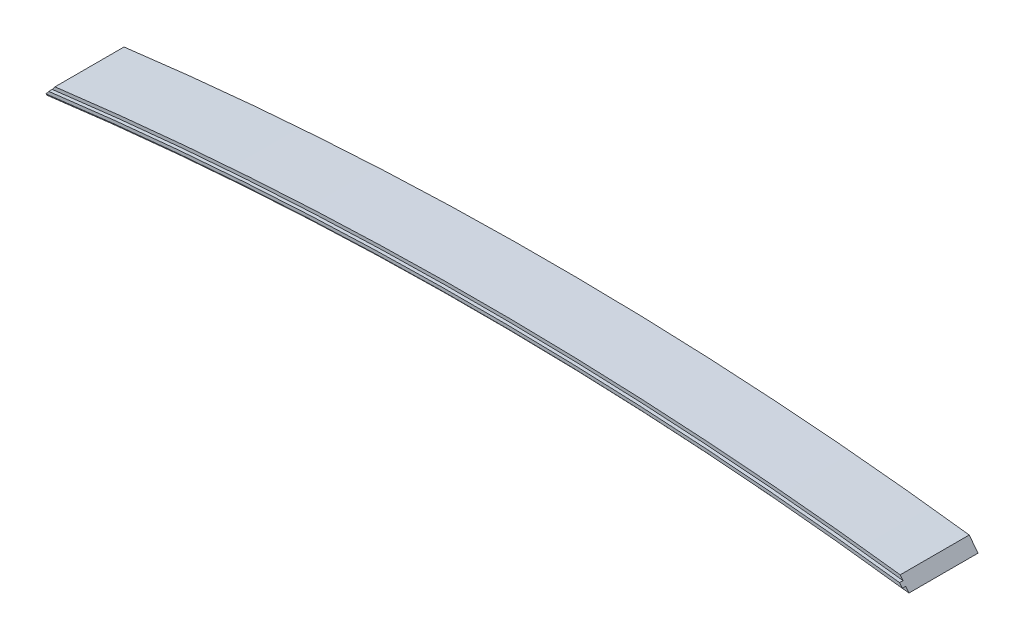
ISO-10303-21;
HEADER;
FILE_DESCRIPTION(('STEP AP214'),'2;1');
FILE_NAME('part.step','',(''),(''),'','','');
FILE_SCHEMA(('AUTOMOTIVE_DESIGN { 1 0 10303 214 1 1 1 1 }'));
ENDSEC;
DATA;
#1=APPLICATION_CONTEXT('core data for automotive mechanical design processes');
#2=APPLICATION_PROTOCOL_DEFINITION('international standard','automotive_design',2000,#1);
#3=PRODUCT_CONTEXT('',#1,'mechanical');
#4=PRODUCT('Part','Part','',(#3));
#5=PRODUCT_RELATED_PRODUCT_CATEGORY('part','',(#4));
#6=PRODUCT_DEFINITION_FORMATION('','',#4);
#7=PRODUCT_DEFINITION_CONTEXT('part definition',#1,'design');
#8=PRODUCT_DEFINITION('design','',#6,#7);
#9=PRODUCT_DEFINITION_SHAPE('','',#8);
#10=(LENGTH_UNIT() NAMED_UNIT(*) SI_UNIT(.MILLI.,.METRE.));
#11=(NAMED_UNIT(*) PLANE_ANGLE_UNIT() SI_UNIT($,.RADIAN.));
#12=(NAMED_UNIT(*) SI_UNIT($,.STERADIAN.) SOLID_ANGLE_UNIT());
#13=UNCERTAINTY_MEASURE_WITH_UNIT(LENGTH_MEASURE(1.E-05),#10,'distance_accuracy_value','');
#14=(GEOMETRIC_REPRESENTATION_CONTEXT(3) GLOBAL_UNCERTAINTY_ASSIGNED_CONTEXT((#13)) GLOBAL_UNIT_ASSIGNED_CONTEXT((#10,
#11,#12)) REPRESENTATION_CONTEXT('',''));
#15=CARTESIAN_POINT('',(0.,0.,0.));
#16=DIRECTION('',(0.,0.,1.));
#17=DIRECTION('',(1.,0.,0.));
#18=AXIS2_PLACEMENT_3D('',#15,#16,#17);
#19=CARTESIAN_POINT('',(0.,-4954.48624508701,101.6));
#20=DIRECTION('',(0.,0.,1.));
#21=DIRECTION('',(1.,0.,0.));
#22=AXIS2_PLACEMENT_3D('',#19,#20,#21);
#23=PLANE('',#22);
#24=CARTESIAN_POINT('',(0.,-4954.48624508701,101.6));
#25=DIRECTION('',(0.,0.,-1.));
#26=DIRECTION('',(1.,0.,0.));
#27=AXIS2_PLACEMENT_3D('',#24,#25,#26);
#28=CIRCLE('',#27,4901.37548046057);
#29=CARTESIAN_POINT('',(-630.252313320326,-93.8007356126036,101.6));
#30=VERTEX_POINT('',#29);
#31=CARTESIAN_POINT('',(630.252313320327,-93.800735612604,101.6));
#32=VERTEX_POINT('',#31);
#33=EDGE_CURVE('E118',#30,#32,#28,.T.);
#34=ORIENTED_EDGE('',*,*,#33,.F.);
#35=DIRECTION('',(-0.609421241288323,-0.792846612319558,0.));
#36=VECTOR('',#35,1.);
#37=CARTESIAN_POINT('',(-635.,-99.9773947857841,101.6));
#38=LINE('',#37,#36);
#39=CARTESIAN_POINT('',(-635.,-99.9773947857854,101.6));
#40=VERTEX_POINT('',#39);
#41=EDGE_CURVE('E131',#30,#40,#38,.T.);
#42=ORIENTED_EDGE('',*,*,#41,.T.);
#43=CARTESIAN_POINT('',(0.,-4954.48624508701,101.6));
#44=DIRECTION('',(0.,0.,-1.));
#45=DIRECTION('',(1.,0.,0.));
#46=AXIS2_PLACEMENT_3D('',#43,#44,#45);
#47=CIRCLE('',#46,4895.86368046057);
#48=CARTESIAN_POINT('',(635.,-99.9773947857841,101.6));
#49=VERTEX_POINT('',#48);
#50=EDGE_CURVE('E135',#40,#49,#47,.T.);
#51=ORIENTED_EDGE('',*,*,#50,.T.);
#52=DIRECTION('',(-0.609421241288271,0.792846612319598,0.));
#53=VECTOR('',#52,1.);
#54=CARTESIAN_POINT('',(635.,-99.9773947857841,101.6));
#55=LINE('',#54,#53);
#56=EDGE_CURVE('E55',#49,#32,#55,.T.);
#57=ORIENTED_EDGE('',*,*,#56,.T.);
#58=EDGE_LOOP('',(#34,#42,#51,#57));
#59=FACE_BOUND('',#58,.T.);
#60=ADVANCED_FACE('F32',(#59),#23,.T.);
#61=CARTESIAN_POINT('',(0.,-4954.48624508701,101.6));
#62=DIRECTION('',(0.,0.,-1.));
#63=DIRECTION('',(-1.,0.,0.));
#64=AXIS2_PLACEMENT_3D('',#61,#62,#63);
#65=CYLINDRICAL_SURFACE('',#64,4910.84968046057);
#66=CARTESIAN_POINT('',(0.,-4954.48624508701,0.));
#67=DIRECTION('',(0.,0.,1.));
#68=DIRECTION('',(1.,0.,0.));
#69=AXIS2_PLACEMENT_3D('',#66,#67,#68);
#70=CIRCLE('',#69,4910.84968046057);
#71=CARTESIAN_POINT('',(622.103936150614,-83.1998362720223,0.));
#72=VERTEX_POINT('',#71);
#73=CARTESIAN_POINT('',(-622.103936150612,-83.1998362720223,0.));
#74=VERTEX_POINT('',#73);
#75=EDGE_CURVE('E119',#72,#74,#70,.T.);
#76=ORIENTED_EDGE('',*,*,#75,.T.);
#77=DIRECTION('',(0.,0.,-1.));
#78=VECTOR('',#77,1.);
#79=CARTESIAN_POINT('',(-622.103936150612,-83.1998362720223,101.6));
#80=LINE('',#79,#78);
#81=CARTESIAN_POINT('',(-622.103936150612,-83.1998362720223,101.6));
#82=VERTEX_POINT('',#81);
#83=EDGE_CURVE('E11',#82,#74,#80,.T.);
#84=ORIENTED_EDGE('',*,*,#83,.F.);
#85=CARTESIAN_POINT('',(0.,-4954.48624508701,101.6));
#86=DIRECTION('',(0.,0.,1.));
#87=DIRECTION('',(1.,0.,0.));
#88=AXIS2_PLACEMENT_3D('',#85,#86,#87);
#89=CIRCLE('',#88,4910.84968046057);
#90=CARTESIAN_POINT('',(622.103936150614,-83.1998362720223,101.6));
#91=VERTEX_POINT('',#90);
#92=EDGE_CURVE('E128',#91,#82,#89,.T.);
#93=ORIENTED_EDGE('',*,*,#92,.F.);
#94=DIRECTION('',(0.,0.,-1.));
#95=VECTOR('',#94,1.);
#96=CARTESIAN_POINT('',(622.103936150614,-83.1998362720223,101.6));
#97=LINE('',#96,#95);
#98=EDGE_CURVE('E138',#91,#72,#97,.T.);
#99=ORIENTED_EDGE('',*,*,#98,.T.);
#100=EDGE_LOOP('',(#76,#84,#93,#99));
#101=FACE_BOUND('',#100,.T.);
#102=ADVANCED_FACE('F34',(#101),#65,.T.);
#103=CARTESIAN_POINT('',(-635.,-99.9773947857841,101.6));
#104=DIRECTION('',(0.792846612319558,-0.609421241288323,0.));
#105=DIRECTION('',(0.609421241288323,0.792846612319558,0.));
#106=AXIS2_PLACEMENT_3D('',#103,#104,#105);
#107=PLANE('',#106);
#108=DIRECTION('',(-0.609421241288323,-0.792846612319558,0.));
#109=VECTOR('',#108,1.);
#110=CARTESIAN_POINT('',(-635.,-99.9773947857841,0.));
#111=LINE('',#110,#109);
#112=CARTESIAN_POINT('',(-635.,-99.9773947857854,0.));
#113=VERTEX_POINT('',#112);
#114=EDGE_CURVE('E122',#74,#113,#111,.T.);
#115=ORIENTED_EDGE('',*,*,#114,.T.);
#116=DIRECTION('',(0.,0.,-1.));
#117=VECTOR('',#116,1.);
#118=CARTESIAN_POINT('',(-635.,-99.9773947857854,101.6));
#119=LINE('',#118,#117);
#120=EDGE_CURVE('E40',#40,#113,#119,.T.);
#121=ORIENTED_EDGE('',*,*,#120,.F.);
#122=ORIENTED_EDGE('',*,*,#41,.F.);
#123=DIRECTION('',(0.,0.,-1.));
#124=VECTOR('',#123,1.);
#125=CARTESIAN_POINT('',(-630.252313320325,-93.800735612604,106.68));
#126=LINE('',#125,#124);
#127=CARTESIAN_POINT('',(-630.252313320325,-93.800735612604,106.68));
#128=VERTEX_POINT('',#127);
#129=EDGE_CURVE('E171',#128,#30,#126,.T.);
#130=ORIENTED_EDGE('',*,*,#129,.F.);
#131=DIRECTION('',(-0.609421241288287,-0.792846612319586,0.));
#132=VECTOR('',#131,1.);
#133=CARTESIAN_POINT('',(-626.208942530533,-88.540379366632,106.68));
#134=LINE('',#133,#132);
#135=CARTESIAN_POINT('',(-626.208942530533,-88.540379366632,106.68));
#136=VERTEX_POINT('',#135);
#137=EDGE_CURVE('E112',#136,#128,#134,.T.);
#138=ORIENTED_EDGE('',*,*,#137,.F.);
#139=DIRECTION('',(0.,0.,-1.));
#140=VECTOR('',#139,1.);
#141=CARTESIAN_POINT('',(-626.208942530533,-88.540379366632,106.68));
#142=LINE('',#141,#140);
#143=CARTESIAN_POINT('',(-626.208942530533,-88.540379366632,101.6));
#144=VERTEX_POINT('',#143);
#145=EDGE_CURVE('E124',#136,#144,#142,.T.);
#146=ORIENTED_EDGE('',*,*,#145,.T.);
#147=EDGE_CURVE('E133',#82,#144,#38,.T.);
#148=ORIENTED_EDGE('',*,*,#147,.F.);
#149=ORIENTED_EDGE('',*,*,#83,.T.);
#150=EDGE_LOOP('',(#115,#121,#122,#130,#138,#146,#148,#149));
#151=FACE_BOUND('',#150,.T.);
#152=ADVANCED_FACE('F176',(#151),#107,.F.);
#153=CARTESIAN_POINT('',(0.,-4954.48624508701,101.6));
#154=DIRECTION('',(0.,0.,-1.));
#155=DIRECTION('',(-1.,0.,0.));
#156=AXIS2_PLACEMENT_3D('',#153,#154,#155);
#157=CYLINDRICAL_SURFACE('',#156,4895.86368046057);
#158=CARTESIAN_POINT('',(0.,-4954.48624508701,0.));
#159=DIRECTION('',(0.,0.,-1.));
#160=DIRECTION('',(1.,0.,0.));
#161=AXIS2_PLACEMENT_3D('',#158,#159,#160);
#162=CIRCLE('',#161,4895.86368046057);
#163=CARTESIAN_POINT('',(635.,-99.9773947857841,0.));
#164=VERTEX_POINT('',#163);
#165=EDGE_CURVE('E141',#113,#164,#162,.T.);
#166=ORIENTED_EDGE('',*,*,#165,.T.);
#167=DIRECTION('',(0.,0.,-1.));
#168=VECTOR('',#167,1.);
#169=CARTESIAN_POINT('',(635.,-99.9773947857841,101.6));
#170=LINE('',#169,#168);
#171=EDGE_CURVE('E146',#49,#164,#170,.T.);
#172=ORIENTED_EDGE('',*,*,#171,.F.);
#173=ORIENTED_EDGE('',*,*,#50,.F.);
#174=ORIENTED_EDGE('',*,*,#120,.T.);
#175=EDGE_LOOP('',(#166,#172,#173,#174));
#176=FACE_BOUND('',#175,.T.);
#177=ADVANCED_FACE('F153',(#176),#157,.F.);
#178=CARTESIAN_POINT('',(635.,-99.9773947857841,101.6));
#179=DIRECTION('',(-0.792846612319598,-0.60942124128827,0.));
#180=DIRECTION('',(0.609421241288271,-0.792846612319599,0.));
#181=AXIS2_PLACEMENT_3D('',#178,#179,#180);
#182=PLANE('',#181);
#183=DIRECTION('',(-0.609421241288271,0.792846612319598,0.));
#184=VECTOR('',#183,1.);
#185=CARTESIAN_POINT('',(635.,-99.9773947857841,0.));
#186=LINE('',#185,#184);
#187=EDGE_CURVE('E132',#164,#72,#186,.T.);
#188=ORIENTED_EDGE('',*,*,#187,.T.);
#189=ORIENTED_EDGE('',*,*,#98,.F.);
#190=CARTESIAN_POINT('',(626.208942530534,-88.5403793666306,101.6));
#191=VERTEX_POINT('',#190);
#192=EDGE_CURVE('E137',#191,#91,#55,.T.);
#193=ORIENTED_EDGE('',*,*,#192,.F.);
#194=DIRECTION('',(0.,0.,-1.));
#195=VECTOR('',#194,1.);
#196=CARTESIAN_POINT('',(626.208942530535,-88.5403793666315,106.68));
#197=LINE('',#196,#195);
#198=CARTESIAN_POINT('',(626.208942530535,-88.5403793666315,106.68));
#199=VERTEX_POINT('',#198);
#200=EDGE_CURVE('E103',#199,#191,#197,.T.);
#201=ORIENTED_EDGE('',*,*,#200,.F.);
#202=DIRECTION('',(-0.609421241288264,0.792846612319603,0.));
#203=VECTOR('',#202,1.);
#204=CARTESIAN_POINT('',(630.252313320328,-93.800735612604,106.68));
#205=LINE('',#204,#203);
#206=CARTESIAN_POINT('',(630.252313320328,-93.800735612604,106.68));
#207=VERTEX_POINT('',#206);
#208=EDGE_CURVE('E96',#207,#199,#205,.T.);
#209=ORIENTED_EDGE('',*,*,#208,.F.);
#210=DIRECTION('',(0.,0.,-1.));
#211=VECTOR('',#210,1.);
#212=CARTESIAN_POINT('',(630.252313320328,-93.800735612604,106.68));
#213=LINE('',#212,#211);
#214=EDGE_CURVE('E100',#207,#32,#213,.T.);
#215=ORIENTED_EDGE('',*,*,#214,.T.);
#216=ORIENTED_EDGE('',*,*,#56,.F.);
#217=ORIENTED_EDGE('',*,*,#171,.T.);
#218=EDGE_LOOP('',(#188,#189,#193,#201,#209,#215,#216,#217));
#219=FACE_BOUND('',#218,.T.);
#220=ADVANCED_FACE('F98',(#219),#182,.F.);
#221=CARTESIAN_POINT('',(0.,-4954.48624508701,101.6));
#222=DIRECTION('',(0.,0.,1.));
#223=DIRECTION('',(1.,0.,0.));
#224=AXIS2_PLACEMENT_3D('',#221,#222,#223);
#225=CIRCLE('',#224,4906.07448046057);
#226=EDGE_CURVE('E47',#191,#144,#225,.T.);
#227=ORIENTED_EDGE('',*,*,#226,.F.);
#228=ORIENTED_EDGE('',*,*,#192,.T.);
#229=ORIENTED_EDGE('',*,*,#92,.T.);
#230=ORIENTED_EDGE('',*,*,#147,.T.);
#231=EDGE_LOOP('',(#227,#228,#229,#230));
#232=FACE_BOUND('',#231,.T.);
#233=ADVANCED_FACE('F165',(#232),#23,.T.);
#234=CARTESIAN_POINT('',(0.,-4954.48624508701,0.));
#235=DIRECTION('',(0.,0.,1.));
#236=DIRECTION('',(1.,0.,0.));
#237=AXIS2_PLACEMENT_3D('',#234,#235,#236);
#238=PLANE('',#237);
#239=ORIENTED_EDGE('',*,*,#75,.F.);
#240=ORIENTED_EDGE('',*,*,#187,.F.);
#241=ORIENTED_EDGE('',*,*,#165,.F.);
#242=ORIENTED_EDGE('',*,*,#114,.F.);
#243=EDGE_LOOP('',(#239,#240,#241,#242));
#244=FACE_BOUND('',#243,.T.);
#245=ADVANCED_FACE('F160',(#244),#238,.F.);
#246=CARTESIAN_POINT('',(0.,-4954.48624508701,106.68));
#247=DIRECTION('',(0.,0.,-1.));
#248=DIRECTION('',(-1.,0.,0.));
#249=AXIS2_PLACEMENT_3D('',#246,#247,#248);
#250=CYLINDRICAL_SURFACE('',#249,4901.37548046057);
#251=ORIENTED_EDGE('',*,*,#33,.T.);
#252=ORIENTED_EDGE('',*,*,#214,.F.);
#253=CARTESIAN_POINT('',(0.,-4954.48624508701,106.68));
#254=DIRECTION('',(0.,0.,-1.));
#255=DIRECTION('',(1.,0.,0.));
#256=AXIS2_PLACEMENT_3D('',#253,#254,#255);
#257=CIRCLE('',#256,4901.37548046057);
#258=EDGE_CURVE('E107',#128,#207,#257,.T.);
#259=ORIENTED_EDGE('',*,*,#258,.F.);
#260=ORIENTED_EDGE('',*,*,#129,.T.);
#261=EDGE_LOOP('',(#251,#252,#259,#260));
#262=FACE_BOUND('',#261,.T.);
#263=ADVANCED_FACE('F117',(#262),#250,.F.);
#264=CARTESIAN_POINT('',(0.,-4954.48624508701,106.68));
#265=DIRECTION('',(0.,0.,-1.));
#266=DIRECTION('',(-1.,0.,0.));
#267=AXIS2_PLACEMENT_3D('',#264,#265,#266);
#268=CYLINDRICAL_SURFACE('',#267,4906.07448046057);
#269=ORIENTED_EDGE('',*,*,#226,.T.);
#270=ORIENTED_EDGE('',*,*,#145,.F.);
#271=CARTESIAN_POINT('',(0.,-4954.48624508701,106.68));
#272=DIRECTION('',(0.,0.,1.));
#273=DIRECTION('',(1.,0.,0.));
#274=AXIS2_PLACEMENT_3D('',#271,#272,#273);
#275=CIRCLE('',#274,4906.07448046057);
#276=EDGE_CURVE('E106',#199,#136,#275,.T.);
#277=ORIENTED_EDGE('',*,*,#276,.F.);
#278=ORIENTED_EDGE('',*,*,#200,.T.);
#279=EDGE_LOOP('',(#269,#270,#277,#278));
#280=FACE_BOUND('',#279,.T.);
#281=ADVANCED_FACE('F167',(#280),#268,.T.);
#282=CARTESIAN_POINT('',(0.,-4954.48624508701,106.68));
#283=DIRECTION('',(0.,0.,1.));
#284=DIRECTION('',(1.,0.,0.));
#285=AXIS2_PLACEMENT_3D('',#282,#283,#284);
#286=PLANE('',#285);
#287=ORIENTED_EDGE('',*,*,#258,.T.);
#288=ORIENTED_EDGE('',*,*,#208,.T.);
#289=ORIENTED_EDGE('',*,*,#276,.T.);
#290=ORIENTED_EDGE('',*,*,#137,.T.);
#291=EDGE_LOOP('',(#287,#288,#289,#290));
#292=FACE_BOUND('',#291,.T.);
#293=ADVANCED_FACE('F110',(#292),#286,.T.);
#294=CLOSED_SHELL('',(#60,#102,#152,#177,#220,#233,#245,#263,#281,#293));
#295=MANIFOLD_SOLID_BREP('B2',#294);
#296=ADVANCED_BREP_SHAPE_REPRESENTATION('',(#18,#295),#14);
#297=SHAPE_DEFINITION_REPRESENTATION(#9,#296);
ENDSEC;
END-ISO-10303-21;
